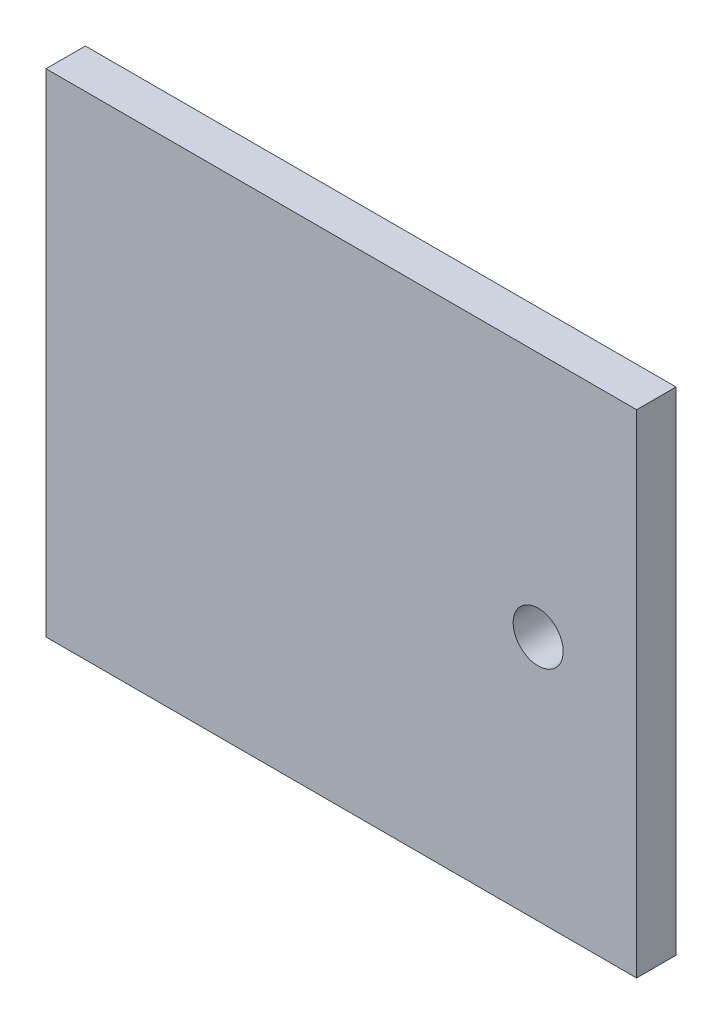
ISO-10303-21;
HEADER;
FILE_DESCRIPTION(('STEP AP214'),'2;1');
FILE_NAME('part.step','',(''),(''),'','','');
FILE_SCHEMA(('AUTOMOTIVE_DESIGN { 1 0 10303 214 1 1 1 1 }'));
ENDSEC;
DATA;
#1=APPLICATION_CONTEXT('core data for automotive mechanical design processes');
#2=APPLICATION_PROTOCOL_DEFINITION('international standard','automotive_design',2000,#1);
#3=PRODUCT_CONTEXT('',#1,'mechanical');
#4=PRODUCT('Part','Part','',(#3));
#5=PRODUCT_RELATED_PRODUCT_CATEGORY('part','',(#4));
#6=PRODUCT_DEFINITION_FORMATION('','',#4);
#7=PRODUCT_DEFINITION_CONTEXT('part definition',#1,'design');
#8=PRODUCT_DEFINITION('design','',#6,#7);
#9=PRODUCT_DEFINITION_SHAPE('','',#8);
#10=(LENGTH_UNIT() NAMED_UNIT(*) SI_UNIT(.MILLI.,.METRE.));
#11=(NAMED_UNIT(*) PLANE_ANGLE_UNIT() SI_UNIT($,.RADIAN.));
#12=(NAMED_UNIT(*) SI_UNIT($,.STERADIAN.) SOLID_ANGLE_UNIT());
#13=UNCERTAINTY_MEASURE_WITH_UNIT(LENGTH_MEASURE(1.E-05),#10,'distance_accuracy_value','');
#14=(GEOMETRIC_REPRESENTATION_CONTEXT(3) GLOBAL_UNCERTAINTY_ASSIGNED_CONTEXT((#13)) GLOBAL_UNIT_ASSIGNED_CONTEXT((#10,
#11,#12)) REPRESENTATION_CONTEXT('',''));
#15=CARTESIAN_POINT('',(0.,0.,0.));
#16=DIRECTION('',(0.,0.,1.));
#17=DIRECTION('',(1.,0.,0.));
#18=AXIS2_PLACEMENT_3D('',#15,#16,#17);
#19=CARTESIAN_POINT('',(150.,-125.,20.));
#20=DIRECTION('',(-1.,0.,0.));
#21=DIRECTION('',(0.,0.,1.));
#22=AXIS2_PLACEMENT_3D('',#19,#20,#21);
#23=PLANE('',#22);
#24=DIRECTION('',(0.,1.,0.));
#25=VECTOR('',#24,1.);
#26=CARTESIAN_POINT('',(150.,-125.,0.));
#27=LINE('',#26,#25);
#28=CARTESIAN_POINT('',(150.,-125.,0.));
#29=VERTEX_POINT('',#28);
#30=CARTESIAN_POINT('',(150.,125.,0.));
#31=VERTEX_POINT('',#30);
#32=EDGE_CURVE('E106',#29,#31,#27,.T.);
#33=ORIENTED_EDGE('',*,*,#32,.T.);
#34=DIRECTION('',(0.,0.,-1.));
#35=VECTOR('',#34,1.);
#36=CARTESIAN_POINT('',(150.,125.,20.));
#37=LINE('',#36,#35);
#38=CARTESIAN_POINT('',(150.,125.,20.));
#39=VERTEX_POINT('',#38);
#40=EDGE_CURVE('E11',#39,#31,#37,.T.);
#41=ORIENTED_EDGE('',*,*,#40,.F.);
#42=DIRECTION('',(0.,1.,0.));
#43=VECTOR('',#42,1.);
#44=CARTESIAN_POINT('',(150.,-125.,20.));
#45=LINE('',#44,#43);
#46=CARTESIAN_POINT('',(150.,-125.,20.));
#47=VERTEX_POINT('',#46);
#48=EDGE_CURVE('E90',#47,#39,#45,.T.);
#49=ORIENTED_EDGE('',*,*,#48,.F.);
#50=DIRECTION('',(0.,0.,-1.));
#51=VECTOR('',#50,1.);
#52=CARTESIAN_POINT('',(150.,-125.,20.));
#53=LINE('',#52,#51);
#54=EDGE_CURVE('E102',#47,#29,#53,.T.);
#55=ORIENTED_EDGE('',*,*,#54,.T.);
#56=EDGE_LOOP('',(#33,#41,#49,#55));
#57=FACE_BOUND('',#56,.T.);
#58=ADVANCED_FACE('F38',(#57),#23,.F.);
#59=CARTESIAN_POINT('',(-150.,125.,20.));
#60=DIRECTION('',(0.,-1.,0.));
#61=DIRECTION('',(0.,0.,-1.));
#62=AXIS2_PLACEMENT_3D('',#59,#60,#61);
#63=PLANE('',#62);
#64=DIRECTION('',(-1.,0.,0.));
#65=VECTOR('',#64,1.);
#66=CARTESIAN_POINT('',(-150.,125.,0.));
#67=LINE('',#66,#65);
#68=CARTESIAN_POINT('',(-150.,125.,0.));
#69=VERTEX_POINT('',#68);
#70=EDGE_CURVE('E95',#31,#69,#67,.T.);
#71=ORIENTED_EDGE('',*,*,#70,.T.);
#72=DIRECTION('',(0.,0.,-1.));
#73=VECTOR('',#72,1.);
#74=CARTESIAN_POINT('',(-150.,125.,20.));
#75=LINE('',#74,#73);
#76=CARTESIAN_POINT('',(-150.,125.,20.));
#77=VERTEX_POINT('',#76);
#78=EDGE_CURVE('E47',#77,#69,#75,.T.);
#79=ORIENTED_EDGE('',*,*,#78,.F.);
#80=DIRECTION('',(-1.,0.,0.));
#81=VECTOR('',#80,1.);
#82=CARTESIAN_POINT('',(-150.,125.,20.));
#83=LINE('',#82,#81);
#84=EDGE_CURVE('E85',#39,#77,#83,.T.);
#85=ORIENTED_EDGE('',*,*,#84,.F.);
#86=ORIENTED_EDGE('',*,*,#40,.T.);
#87=EDGE_LOOP('',(#71,#79,#85,#86));
#88=FACE_BOUND('',#87,.T.);
#89=ADVANCED_FACE('F94',(#88),#63,.F.);
#90=CARTESIAN_POINT('',(-150.,-125.,20.));
#91=DIRECTION('',(1.,0.,0.));
#92=DIRECTION('',(0.,0.,-1.));
#93=AXIS2_PLACEMENT_3D('',#90,#91,#92);
#94=PLANE('',#93);
#95=DIRECTION('',(0.,-1.,0.));
#96=VECTOR('',#95,1.);
#97=CARTESIAN_POINT('',(-150.,-125.,0.));
#98=LINE('',#97,#96);
#99=CARTESIAN_POINT('',(-150.,-125.,0.));
#100=VERTEX_POINT('',#99);
#101=EDGE_CURVE('E72',#69,#100,#98,.T.);
#102=ORIENTED_EDGE('',*,*,#101,.T.);
#103=DIRECTION('',(0.,0.,-1.));
#104=VECTOR('',#103,1.);
#105=CARTESIAN_POINT('',(-150.,-125.,20.));
#106=LINE('',#105,#104);
#107=CARTESIAN_POINT('',(-150.,-125.,20.));
#108=VERTEX_POINT('',#107);
#109=EDGE_CURVE('E97',#108,#100,#106,.T.);
#110=ORIENTED_EDGE('',*,*,#109,.F.);
#111=DIRECTION('',(0.,-1.,0.));
#112=VECTOR('',#111,1.);
#113=CARTESIAN_POINT('',(-150.,-125.,20.));
#114=LINE('',#113,#112);
#115=EDGE_CURVE('E88',#77,#108,#114,.T.);
#116=ORIENTED_EDGE('',*,*,#115,.F.);
#117=ORIENTED_EDGE('',*,*,#78,.T.);
#118=EDGE_LOOP('',(#102,#110,#116,#117));
#119=FACE_BOUND('',#118,.T.);
#120=ADVANCED_FACE('F98',(#119),#94,.F.);
#121=CARTESIAN_POINT('',(-150.,-125.,20.));
#122=DIRECTION('',(0.,1.,0.));
#123=DIRECTION('',(0.,0.,1.));
#124=AXIS2_PLACEMENT_3D('',#121,#122,#123);
#125=PLANE('',#124);
#126=DIRECTION('',(1.,0.,0.));
#127=VECTOR('',#126,1.);
#128=CARTESIAN_POINT('',(-150.,-125.,0.));
#129=LINE('',#128,#127);
#130=EDGE_CURVE('E78',#100,#29,#129,.T.);
#131=ORIENTED_EDGE('',*,*,#130,.T.);
#132=ORIENTED_EDGE('',*,*,#54,.F.);
#133=DIRECTION('',(1.,0.,0.));
#134=VECTOR('',#133,1.);
#135=CARTESIAN_POINT('',(-150.,-125.,20.));
#136=LINE('',#135,#134);
#137=EDGE_CURVE('E55',#108,#47,#136,.T.);
#138=ORIENTED_EDGE('',*,*,#137,.F.);
#139=ORIENTED_EDGE('',*,*,#109,.T.);
#140=EDGE_LOOP('',(#131,#132,#138,#139));
#141=FACE_BOUND('',#140,.T.);
#142=ADVANCED_FACE('F120',(#141),#125,.F.);
#143=CARTESIAN_POINT('',(0.,0.,20.));
#144=DIRECTION('',(0.,0.,-1.));
#145=DIRECTION('',(-1.,0.,0.));
#146=AXIS2_PLACEMENT_3D('',#143,#144,#145);
#147=PLANE('',#146);
#148=CARTESIAN_POINT('',(100.,0.,20.));
#149=DIRECTION('',(0.,0.,1.));
#150=DIRECTION('',(1.,0.,0.));
#151=AXIS2_PLACEMENT_3D('',#148,#149,#150);
#152=CIRCLE('',#151,12.7);
#153=CARTESIAN_POINT('',(112.7,0.,20.));
#154=VERTEX_POINT('',#153);
#155=EDGE_CURVE('E127',#154,#154,#152,.T.);
#156=ORIENTED_EDGE('',*,*,#155,.F.);
#157=EDGE_LOOP('',(#156));
#158=FACE_BOUND('',#157,.T.);
#159=ORIENTED_EDGE('',*,*,#48,.T.);
#160=ORIENTED_EDGE('',*,*,#84,.T.);
#161=ORIENTED_EDGE('',*,*,#115,.T.);
#162=ORIENTED_EDGE('',*,*,#137,.T.);
#163=EDGE_LOOP('',(#159,#160,#161,#162));
#164=FACE_BOUND('',#163,.T.);
#165=ADVANCED_FACE('F86',(#158,#164),#147,.F.);
#166=CARTESIAN_POINT('',(0.,0.,0.));
#167=DIRECTION('',(0.,0.,-1.));
#168=DIRECTION('',(-1.,0.,0.));
#169=AXIS2_PLACEMENT_3D('',#166,#167,#168);
#170=PLANE('',#169);
#171=CARTESIAN_POINT('',(100.,0.,0.));
#172=DIRECTION('',(0.,0.,1.));
#173=DIRECTION('',(1.,0.,0.));
#174=AXIS2_PLACEMENT_3D('',#171,#172,#173);
#175=CIRCLE('',#174,12.7);
#176=CARTESIAN_POINT('',(112.7,0.,0.));
#177=VERTEX_POINT('',#176);
#178=EDGE_CURVE('E110',#177,#177,#175,.T.);
#179=ORIENTED_EDGE('',*,*,#178,.T.);
#180=EDGE_LOOP('',(#179));
#181=FACE_BOUND('',#180,.T.);
#182=ORIENTED_EDGE('',*,*,#32,.F.);
#183=ORIENTED_EDGE('',*,*,#130,.F.);
#184=ORIENTED_EDGE('',*,*,#101,.F.);
#185=ORIENTED_EDGE('',*,*,#70,.F.);
#186=EDGE_LOOP('',(#182,#183,#184,#185));
#187=FACE_BOUND('',#186,.T.);
#188=ADVANCED_FACE('F123',(#181,#187),#170,.T.);
#189=CARTESIAN_POINT('',(100.,0.,0.));
#190=DIRECTION('',(0.,0.,1.));
#191=DIRECTION('',(1.,0.,0.));
#192=AXIS2_PLACEMENT_3D('',#189,#190,#191);
#193=CYLINDRICAL_SURFACE('',#192,12.7);
#194=ORIENTED_EDGE('',*,*,#178,.F.);
#195=EDGE_LOOP('',(#194));
#196=FACE_BOUND('',#195,.T.);
#197=ORIENTED_EDGE('',*,*,#155,.T.);
#198=EDGE_LOOP('',(#197));
#199=FACE_BOUND('',#198,.T.);
#200=ADVANCED_FACE('F136',(#196,#199),#193,.F.);
#201=CLOSED_SHELL('',(#58,#89,#120,#142,#165,#188,#200));
#202=MANIFOLD_SOLID_BREP('B2',#201);
#203=ADVANCED_BREP_SHAPE_REPRESENTATION('',(#18,#202),#14);
#204=SHAPE_DEFINITION_REPRESENTATION(#9,#203);
ENDSEC;
END-ISO-10303-21;
